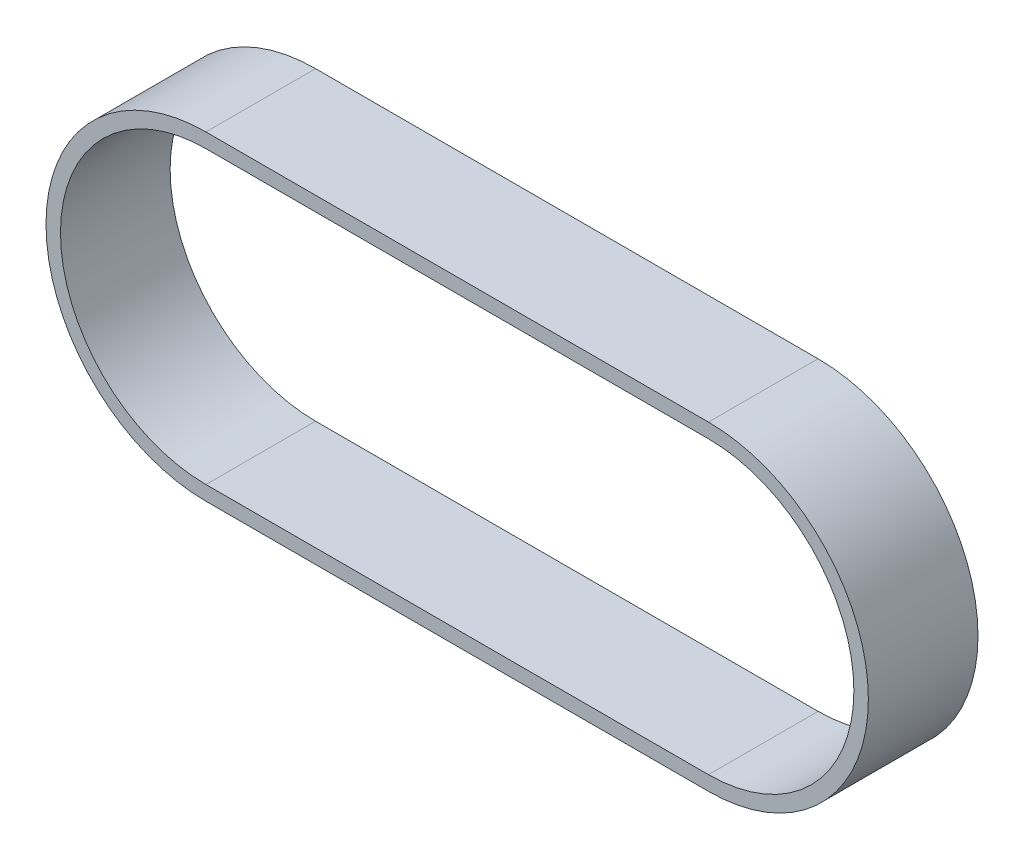
ISO-10303-21;
HEADER;
FILE_DESCRIPTION(('STEP AP214'),'2;1');
FILE_NAME('part.step','',(''),(''),'','','');
FILE_SCHEMA(('AUTOMOTIVE_DESIGN { 1 0 10303 214 1 1 1 1 }'));
ENDSEC;
DATA;
#1=APPLICATION_CONTEXT('core data for automotive mechanical design processes');
#2=APPLICATION_PROTOCOL_DEFINITION('international standard','automotive_design',2000,#1);
#3=PRODUCT_CONTEXT('',#1,'mechanical');
#4=PRODUCT('Part','Part','',(#3));
#5=PRODUCT_RELATED_PRODUCT_CATEGORY('part','',(#4));
#6=PRODUCT_DEFINITION_FORMATION('','',#4);
#7=PRODUCT_DEFINITION_CONTEXT('part definition',#1,'design');
#8=PRODUCT_DEFINITION('design','',#6,#7);
#9=PRODUCT_DEFINITION_SHAPE('','',#8);
#10=(LENGTH_UNIT() NAMED_UNIT(*) SI_UNIT(.MILLI.,.METRE.));
#11=(NAMED_UNIT(*) PLANE_ANGLE_UNIT() SI_UNIT($,.RADIAN.));
#12=(NAMED_UNIT(*) SI_UNIT($,.STERADIAN.) SOLID_ANGLE_UNIT());
#13=UNCERTAINTY_MEASURE_WITH_UNIT(LENGTH_MEASURE(1.E-05),#10,'distance_accuracy_value','');
#14=(GEOMETRIC_REPRESENTATION_CONTEXT(3) GLOBAL_UNCERTAINTY_ASSIGNED_CONTEXT((#13)) GLOBAL_UNIT_ASSIGNED_CONTEXT((#10,
#11,#12)) REPRESENTATION_CONTEXT('',''));
#15=CARTESIAN_POINT('',(0.,0.,0.));
#16=DIRECTION('',(0.,0.,1.));
#17=DIRECTION('',(1.,0.,0.));
#18=AXIS2_PLACEMENT_3D('',#15,#16,#17);
#19=CARTESIAN_POINT('',(0.,0.,12.));
#20=DIRECTION('',(0.,0.,1.));
#21=DIRECTION('',(1.,0.,0.));
#22=AXIS2_PLACEMENT_3D('',#19,#20,#21);
#23=PLANE('',#22);
#24=CARTESIAN_POINT('',(0.,0.,12.));
#25=DIRECTION('',(0.,0.,1.));
#26=DIRECTION('',(1.,0.,0.));
#27=AXIS2_PLACEMENT_3D('',#24,#25,#26);
#28=CIRCLE('',#27,17.5);
#29=CARTESIAN_POINT('',(0.,17.5,12.));
#30=VERTEX_POINT('',#29);
#31=CARTESIAN_POINT('',(0.,-17.5,12.));
#32=VERTEX_POINT('',#31);
#33=EDGE_CURVE('E132',#30,#32,#28,.T.);
#34=ORIENTED_EDGE('',*,*,#33,.T.);
#35=DIRECTION('',(1.,0.,0.));
#36=VECTOR('',#35,1.);
#37=CARTESIAN_POINT('',(0.,-17.5,12.));
#38=LINE('',#37,#36);
#39=CARTESIAN_POINT('',(55.,-17.5,12.));
#40=VERTEX_POINT('',#39);
#41=EDGE_CURVE('E135',#32,#40,#38,.T.);
#42=ORIENTED_EDGE('',*,*,#41,.T.);
#43=CARTESIAN_POINT('',(55.,0.,12.));
#44=DIRECTION('',(0.,0.,1.));
#45=DIRECTION('',(1.,0.,0.));
#46=AXIS2_PLACEMENT_3D('',#43,#44,#45);
#47=CIRCLE('',#46,17.5);
#48=CARTESIAN_POINT('',(55.,17.5,12.));
#49=VERTEX_POINT('',#48);
#50=EDGE_CURVE('E138',#40,#49,#47,.T.);
#51=ORIENTED_EDGE('',*,*,#50,.T.);
#52=DIRECTION('',(-1.,0.,0.));
#53=VECTOR('',#52,1.);
#54=CARTESIAN_POINT('',(0.,17.5,12.));
#55=LINE('',#54,#53);
#56=EDGE_CURVE('E140',#49,#30,#55,.T.);
#57=ORIENTED_EDGE('',*,*,#56,.T.);
#58=EDGE_LOOP('',(#34,#42,#51,#57));
#59=FACE_BOUND('',#58,.T.);
#60=DIRECTION('',(1.,0.,0.));
#61=VECTOR('',#60,1.);
#62=CARTESIAN_POINT('',(0.,-15.915,12.));
#63=LINE('',#62,#61);
#64=CARTESIAN_POINT('',(0.,-15.915,12.));
#65=VERTEX_POINT('',#64);
#66=CARTESIAN_POINT('',(55.,-15.915,12.));
#67=VERTEX_POINT('',#66);
#68=EDGE_CURVE('E104',#65,#67,#63,.T.);
#69=ORIENTED_EDGE('',*,*,#68,.F.);
#70=CARTESIAN_POINT('',(0.,0.,12.));
#71=DIRECTION('',(0.,0.,1.));
#72=DIRECTION('',(1.,0.,0.));
#73=AXIS2_PLACEMENT_3D('',#70,#71,#72);
#74=CIRCLE('',#73,15.915);
#75=CARTESIAN_POINT('',(0.,15.915,12.));
#76=VERTEX_POINT('',#75);
#77=EDGE_CURVE('E96',#76,#65,#74,.T.);
#78=ORIENTED_EDGE('',*,*,#77,.F.);
#79=DIRECTION('',(-1.,0.,0.));
#80=VECTOR('',#79,1.);
#81=CARTESIAN_POINT('',(0.,15.915,12.));
#82=LINE('',#81,#80);
#83=CARTESIAN_POINT('',(55.,15.915,12.));
#84=VERTEX_POINT('',#83);
#85=EDGE_CURVE('E118',#84,#76,#82,.T.);
#86=ORIENTED_EDGE('',*,*,#85,.F.);
#87=CARTESIAN_POINT('',(55.,0.,12.));
#88=DIRECTION('',(0.,0.,1.));
#89=DIRECTION('',(1.,0.,0.));
#90=AXIS2_PLACEMENT_3D('',#87,#88,#89);
#91=CIRCLE('',#90,15.915);
#92=EDGE_CURVE('E116',#67,#84,#91,.T.);
#93=ORIENTED_EDGE('',*,*,#92,.F.);
#94=EDGE_LOOP('',(#69,#78,#86,#93));
#95=FACE_BOUND('',#94,.T.);
#96=ADVANCED_FACE('F31',(#59,#95),#23,.T.);
#97=CARTESIAN_POINT('',(0.,0.,0.));
#98=DIRECTION('',(0.,0.,1.));
#99=DIRECTION('',(1.,0.,0.));
#100=AXIS2_PLACEMENT_3D('',#97,#98,#99);
#101=PLANE('',#100);
#102=CARTESIAN_POINT('',(0.,0.,0.));
#103=DIRECTION('',(0.,0.,1.));
#104=DIRECTION('',(1.,0.,0.));
#105=AXIS2_PLACEMENT_3D('',#102,#103,#104);
#106=CIRCLE('',#105,17.5);
#107=CARTESIAN_POINT('',(0.,17.5,0.));
#108=VERTEX_POINT('',#107);
#109=CARTESIAN_POINT('',(0.,-17.5,0.));
#110=VERTEX_POINT('',#109);
#111=EDGE_CURVE('E112',#108,#110,#106,.T.);
#112=ORIENTED_EDGE('',*,*,#111,.F.);
#113=DIRECTION('',(-1.,0.,0.));
#114=VECTOR('',#113,1.);
#115=CARTESIAN_POINT('',(0.,17.5,0.));
#116=LINE('',#115,#114);
#117=CARTESIAN_POINT('',(55.,17.5,0.));
#118=VERTEX_POINT('',#117);
#119=EDGE_CURVE('E136',#118,#108,#116,.T.);
#120=ORIENTED_EDGE('',*,*,#119,.F.);
#121=CARTESIAN_POINT('',(55.,0.,0.));
#122=DIRECTION('',(0.,0.,1.));
#123=DIRECTION('',(1.,0.,0.));
#124=AXIS2_PLACEMENT_3D('',#121,#122,#123);
#125=CIRCLE('',#124,17.5);
#126=CARTESIAN_POINT('',(55.,-17.5,0.));
#127=VERTEX_POINT('',#126);
#128=EDGE_CURVE('E147',#127,#118,#125,.T.);
#129=ORIENTED_EDGE('',*,*,#128,.F.);
#130=DIRECTION('',(1.,0.,0.));
#131=VECTOR('',#130,1.);
#132=CARTESIAN_POINT('',(0.,-17.5,0.));
#133=LINE('',#132,#131);
#134=EDGE_CURVE('E145',#110,#127,#133,.T.);
#135=ORIENTED_EDGE('',*,*,#134,.F.);
#136=EDGE_LOOP('',(#112,#120,#129,#135));
#137=FACE_BOUND('',#136,.T.);
#138=CARTESIAN_POINT('',(0.,0.,0.));
#139=DIRECTION('',(0.,0.,1.));
#140=DIRECTION('',(1.,0.,0.));
#141=AXIS2_PLACEMENT_3D('',#138,#139,#140);
#142=CIRCLE('',#141,15.915);
#143=CARTESIAN_POINT('',(0.,15.915,0.));
#144=VERTEX_POINT('',#143);
#145=CARTESIAN_POINT('',(0.,-15.915,0.));
#146=VERTEX_POINT('',#145);
#147=EDGE_CURVE('E54',#144,#146,#142,.T.);
#148=ORIENTED_EDGE('',*,*,#147,.T.);
#149=DIRECTION('',(1.,0.,0.));
#150=VECTOR('',#149,1.);
#151=CARTESIAN_POINT('',(0.,-15.915,0.));
#152=LINE('',#151,#150);
#153=CARTESIAN_POINT('',(55.,-15.915,0.));
#154=VERTEX_POINT('',#153);
#155=EDGE_CURVE('E111',#146,#154,#152,.T.);
#156=ORIENTED_EDGE('',*,*,#155,.T.);
#157=CARTESIAN_POINT('',(55.,0.,0.));
#158=DIRECTION('',(0.,0.,1.));
#159=DIRECTION('',(1.,0.,0.));
#160=AXIS2_PLACEMENT_3D('',#157,#158,#159);
#161=CIRCLE('',#160,15.915);
#162=CARTESIAN_POINT('',(55.,15.915,0.));
#163=VERTEX_POINT('',#162);
#164=EDGE_CURVE('E124',#154,#163,#161,.T.);
#165=ORIENTED_EDGE('',*,*,#164,.T.);
#166=DIRECTION('',(-1.,0.,0.));
#167=VECTOR('',#166,1.);
#168=CARTESIAN_POINT('',(0.,15.915,0.));
#169=LINE('',#168,#167);
#170=EDGE_CURVE('E105',#163,#144,#169,.T.);
#171=ORIENTED_EDGE('',*,*,#170,.T.);
#172=EDGE_LOOP('',(#148,#156,#165,#171));
#173=FACE_BOUND('',#172,.T.);
#174=ADVANCED_FACE('F165',(#137,#173),#101,.F.);
#175=CARTESIAN_POINT('',(0.,0.,12.));
#176=DIRECTION('',(0.,0.,-1.));
#177=DIRECTION('',(-1.,0.,0.));
#178=AXIS2_PLACEMENT_3D('',#175,#176,#177);
#179=CYLINDRICAL_SURFACE('',#178,17.5);
#180=ORIENTED_EDGE('',*,*,#111,.T.);
#181=DIRECTION('',(0.,0.,-1.));
#182=VECTOR('',#181,1.);
#183=CARTESIAN_POINT('',(0.,-17.5,12.));
#184=LINE('',#183,#182);
#185=EDGE_CURVE('E11',#32,#110,#184,.T.);
#186=ORIENTED_EDGE('',*,*,#185,.F.);
#187=ORIENTED_EDGE('',*,*,#33,.F.);
#188=DIRECTION('',(0.,0.,-1.));
#189=VECTOR('',#188,1.);
#190=CARTESIAN_POINT('',(0.,17.5,12.));
#191=LINE('',#190,#189);
#192=EDGE_CURVE('E142',#30,#108,#191,.T.);
#193=ORIENTED_EDGE('',*,*,#192,.T.);
#194=EDGE_LOOP('',(#180,#186,#187,#193));
#195=FACE_BOUND('',#194,.T.);
#196=ADVANCED_FACE('F33',(#195),#179,.T.);
#197=CARTESIAN_POINT('',(0.,-17.5,12.));
#198=DIRECTION('',(0.,1.,0.));
#199=DIRECTION('',(-1.,0.,0.));
#200=AXIS2_PLACEMENT_3D('',#197,#198,#199);
#201=PLANE('',#200);
#202=ORIENTED_EDGE('',*,*,#134,.T.);
#203=DIRECTION('',(0.,0.,-1.));
#204=VECTOR('',#203,1.);
#205=CARTESIAN_POINT('',(55.,-17.5,12.));
#206=LINE('',#205,#204);
#207=EDGE_CURVE('E39',#40,#127,#206,.T.);
#208=ORIENTED_EDGE('',*,*,#207,.F.);
#209=ORIENTED_EDGE('',*,*,#41,.F.);
#210=ORIENTED_EDGE('',*,*,#185,.T.);
#211=EDGE_LOOP('',(#202,#208,#209,#210));
#212=FACE_BOUND('',#211,.T.);
#213=ADVANCED_FACE('F175',(#212),#201,.F.);
#214=CARTESIAN_POINT('',(55.,0.,12.));
#215=DIRECTION('',(0.,0.,-1.));
#216=DIRECTION('',(-1.,0.,0.));
#217=AXIS2_PLACEMENT_3D('',#214,#215,#216);
#218=CYLINDRICAL_SURFACE('',#217,17.5);
#219=ORIENTED_EDGE('',*,*,#128,.T.);
#220=DIRECTION('',(0.,0.,-1.));
#221=VECTOR('',#220,1.);
#222=CARTESIAN_POINT('',(55.,17.5,12.));
#223=LINE('',#222,#221);
#224=EDGE_CURVE('E152',#49,#118,#223,.T.);
#225=ORIENTED_EDGE('',*,*,#224,.F.);
#226=ORIENTED_EDGE('',*,*,#50,.F.);
#227=ORIENTED_EDGE('',*,*,#207,.T.);
#228=EDGE_LOOP('',(#219,#225,#226,#227));
#229=FACE_BOUND('',#228,.T.);
#230=ADVANCED_FACE('F159',(#229),#218,.T.);
#231=CARTESIAN_POINT('',(0.,17.5,12.));
#232=DIRECTION('',(0.,-1.,0.));
#233=DIRECTION('',(1.,0.,0.));
#234=AXIS2_PLACEMENT_3D('',#231,#232,#233);
#235=PLANE('',#234);
#236=ORIENTED_EDGE('',*,*,#119,.T.);
#237=ORIENTED_EDGE('',*,*,#192,.F.);
#238=ORIENTED_EDGE('',*,*,#56,.F.);
#239=ORIENTED_EDGE('',*,*,#224,.T.);
#240=EDGE_LOOP('',(#236,#237,#238,#239));
#241=FACE_BOUND('',#240,.T.);
#242=ADVANCED_FACE('F169',(#241),#235,.F.);
#243=CARTESIAN_POINT('',(0.,0.,12.));
#244=DIRECTION('',(0.,0.,-1.));
#245=DIRECTION('',(-1.,0.,0.));
#246=AXIS2_PLACEMENT_3D('',#243,#244,#245);
#247=CYLINDRICAL_SURFACE('',#246,15.915);
#248=ORIENTED_EDGE('',*,*,#147,.F.);
#249=DIRECTION('',(0.,0.,-1.));
#250=VECTOR('',#249,1.);
#251=CARTESIAN_POINT('',(0.,15.915,12.));
#252=LINE('',#251,#250);
#253=EDGE_CURVE('E100',#76,#144,#252,.T.);
#254=ORIENTED_EDGE('',*,*,#253,.F.);
#255=ORIENTED_EDGE('',*,*,#77,.T.);
#256=DIRECTION('',(0.,0.,-1.));
#257=VECTOR('',#256,1.);
#258=CARTESIAN_POINT('',(0.,-15.915,12.));
#259=LINE('',#258,#257);
#260=EDGE_CURVE('E99',#65,#146,#259,.T.);
#261=ORIENTED_EDGE('',*,*,#260,.T.);
#262=EDGE_LOOP('',(#248,#254,#255,#261));
#263=FACE_BOUND('',#262,.T.);
#264=ADVANCED_FACE('F98',(#263),#247,.F.);
#265=CARTESIAN_POINT('',(0.,-15.915,12.));
#266=DIRECTION('',(0.,1.,0.));
#267=DIRECTION('',(0.,0.,1.));
#268=AXIS2_PLACEMENT_3D('',#265,#266,#267);
#269=PLANE('',#268);
#270=ORIENTED_EDGE('',*,*,#155,.F.);
#271=ORIENTED_EDGE('',*,*,#260,.F.);
#272=ORIENTED_EDGE('',*,*,#68,.T.);
#273=DIRECTION('',(0.,0.,-1.));
#274=VECTOR('',#273,1.);
#275=CARTESIAN_POINT('',(55.,-15.915,12.));
#276=LINE('',#275,#274);
#277=EDGE_CURVE('E113',#67,#154,#276,.T.);
#278=ORIENTED_EDGE('',*,*,#277,.T.);
#279=EDGE_LOOP('',(#270,#271,#272,#278));
#280=FACE_BOUND('',#279,.T.);
#281=ADVANCED_FACE('F108',(#280),#269,.T.);
#282=CARTESIAN_POINT('',(55.,0.,12.));
#283=DIRECTION('',(0.,0.,-1.));
#284=DIRECTION('',(-1.,0.,0.));
#285=AXIS2_PLACEMENT_3D('',#282,#283,#284);
#286=CYLINDRICAL_SURFACE('',#285,15.915);
#287=ORIENTED_EDGE('',*,*,#164,.F.);
#288=ORIENTED_EDGE('',*,*,#277,.F.);
#289=ORIENTED_EDGE('',*,*,#92,.T.);
#290=DIRECTION('',(0.,0.,-1.));
#291=VECTOR('',#290,1.);
#292=CARTESIAN_POINT('',(55.,15.915,12.));
#293=LINE('',#292,#291);
#294=EDGE_CURVE('E46',#84,#163,#293,.T.);
#295=ORIENTED_EDGE('',*,*,#294,.T.);
#296=EDGE_LOOP('',(#287,#288,#289,#295));
#297=FACE_BOUND('',#296,.T.);
#298=ADVANCED_FACE('F198',(#297),#286,.F.);
#299=CARTESIAN_POINT('',(0.,15.915,12.));
#300=DIRECTION('',(0.,-1.,0.));
#301=DIRECTION('',(0.,0.,-1.));
#302=AXIS2_PLACEMENT_3D('',#299,#300,#301);
#303=PLANE('',#302);
#304=ORIENTED_EDGE('',*,*,#170,.F.);
#305=ORIENTED_EDGE('',*,*,#294,.F.);
#306=ORIENTED_EDGE('',*,*,#85,.T.);
#307=ORIENTED_EDGE('',*,*,#253,.T.);
#308=EDGE_LOOP('',(#304,#305,#306,#307));
#309=FACE_BOUND('',#308,.T.);
#310=ADVANCED_FACE('F202',(#309),#303,.T.);
#311=CLOSED_SHELL('',(#96,#174,#196,#213,#230,#242,#264,#281,#298,#310));
#312=MANIFOLD_SOLID_BREP('B2',#311);
#313=ADVANCED_BREP_SHAPE_REPRESENTATION('',(#18,#312),#14);
#314=SHAPE_DEFINITION_REPRESENTATION(#9,#313);
ENDSEC;
END-ISO-10303-21;
